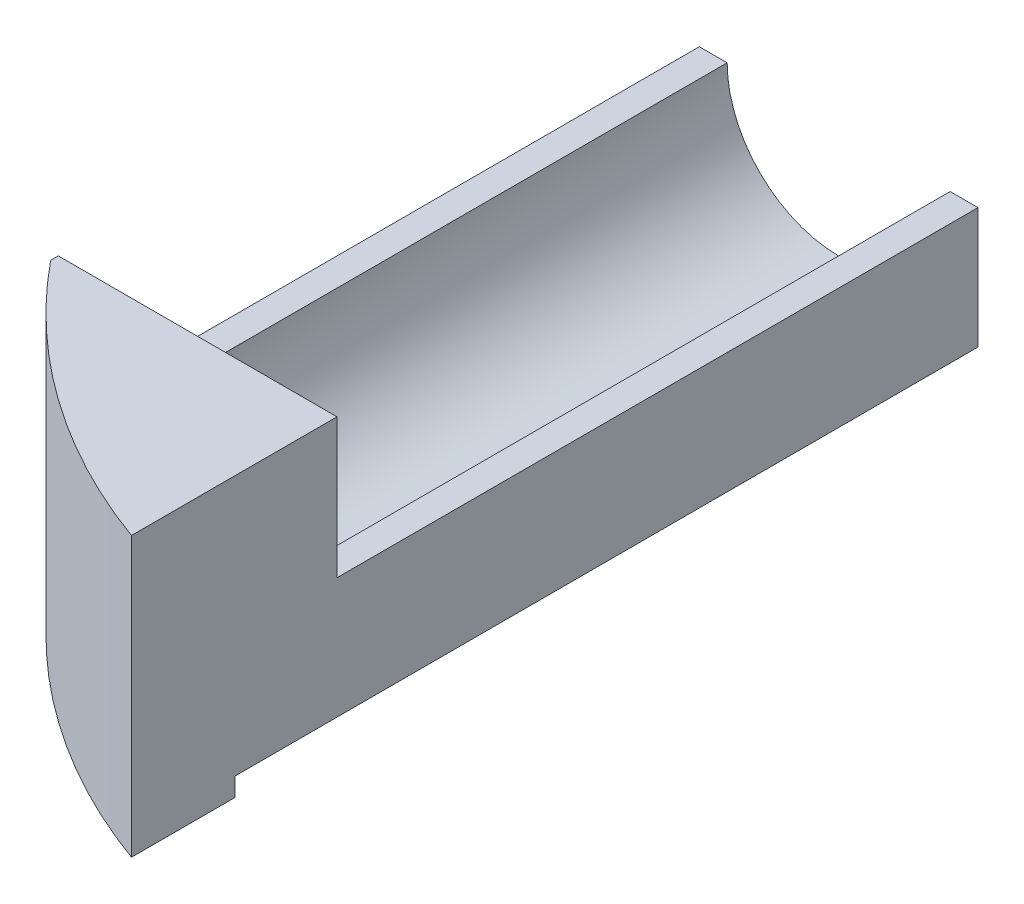
ISO-10303-21;
HEADER;
FILE_DESCRIPTION(('STEP AP214'),'2;1');
FILE_NAME('part.step','',(''),(''),'','','');
FILE_SCHEMA(('AUTOMOTIVE_DESIGN { 1 0 10303 214 1 1 1 1 }'));
ENDSEC;
DATA;
#1=APPLICATION_CONTEXT('core data for automotive mechanical design processes');
#2=APPLICATION_PROTOCOL_DEFINITION('international standard','automotive_design',2000,#1);
#3=PRODUCT_CONTEXT('',#1,'mechanical');
#4=PRODUCT('Part','Part','',(#3));
#5=PRODUCT_RELATED_PRODUCT_CATEGORY('part','',(#4));
#6=PRODUCT_DEFINITION_FORMATION('','',#4);
#7=PRODUCT_DEFINITION_CONTEXT('part definition',#1,'design');
#8=PRODUCT_DEFINITION('design','',#6,#7);
#9=PRODUCT_DEFINITION_SHAPE('','',#8);
#10=(LENGTH_UNIT() NAMED_UNIT(*) SI_UNIT(.MILLI.,.METRE.));
#11=(NAMED_UNIT(*) PLANE_ANGLE_UNIT() SI_UNIT($,.RADIAN.));
#12=(NAMED_UNIT(*) SI_UNIT($,.STERADIAN.) SOLID_ANGLE_UNIT());
#13=UNCERTAINTY_MEASURE_WITH_UNIT(LENGTH_MEASURE(1.E-05),#10,'distance_accuracy_value','');
#14=(GEOMETRIC_REPRESENTATION_CONTEXT(3) GLOBAL_UNCERTAINTY_ASSIGNED_CONTEXT((#13)) GLOBAL_UNIT_ASSIGNED_CONTEXT((#10,
#11,#12)) REPRESENTATION_CONTEXT('',''));
#15=CARTESIAN_POINT('',(0.,0.,0.));
#16=DIRECTION('',(0.,0.,1.));
#17=DIRECTION('',(1.,0.,0.));
#18=AXIS2_PLACEMENT_3D('',#15,#16,#17);
#19=CARTESIAN_POINT('',(-30.,30.,100.));
#20=DIRECTION('',(0.,-1.,0.));
#21=DIRECTION('',(0.,0.,-1.));
#22=AXIS2_PLACEMENT_3D('',#19,#20,#21);
#23=PLANE('',#22);
#24=DIRECTION('',(1.,0.,0.));
#25=VECTOR('',#24,1.);
#26=CARTESIAN_POINT('',(0.,30.,69.));
#27=LINE('',#26,#25);
#28=CARTESIAN_POINT('',(-30.,30.,69.));
#29=VERTEX_POINT('',#28);
#30=CARTESIAN_POINT('',(0.,30.,69.));
#31=VERTEX_POINT('',#30);
#32=EDGE_CURVE('E140',#29,#31,#27,.T.);
#33=ORIENTED_EDGE('',*,*,#32,.F.);
#34=DIRECTION('',(0.,0.,-1.));
#35=VECTOR('',#34,1.);
#36=CARTESIAN_POINT('',(-30.,30.,100.));
#37=LINE('',#36,#35);
#38=CARTESIAN_POINT('',(-30.,30.,69.8246485929605));
#39=VERTEX_POINT('',#38);
#40=EDGE_CURVE('E48',#39,#29,#37,.T.);
#41=ORIENTED_EDGE('',*,*,#40,.F.);
#42=CARTESIAN_POINT('',(23.5,30.,26.25));
#43=DIRECTION('',(0.,-1.,0.));
#44=DIRECTION('',(1.,0.,0.));
#45=AXIS2_PLACEMENT_3D('',#42,#43,#44);
#46=CIRCLE('',#45,69.);
#47=CARTESIAN_POINT('',(0.,30.,91.1248795759961));
#48=VERTEX_POINT('',#47);
#49=EDGE_CURVE('E162',#48,#39,#46,.T.);
#50=ORIENTED_EDGE('',*,*,#49,.F.);
#51=DIRECTION('',(0.,0.,-1.));
#52=VECTOR('',#51,1.);
#53=CARTESIAN_POINT('',(0.,30.,100.));
#54=LINE('',#53,#52);
#55=EDGE_CURVE('E12',#48,#31,#54,.T.);
#56=ORIENTED_EDGE('',*,*,#55,.T.);
#57=EDGE_LOOP('',(#33,#41,#50,#56));
#58=FACE_BOUND('',#57,.T.);
#59=ADVANCED_FACE('F40',(#58),#23,.F.);
#60=CARTESIAN_POINT('',(0.,30.,100.));
#61=DIRECTION('',(-1.,0.,0.));
#62=DIRECTION('',(0.,-1.,0.));
#63=AXIS2_PLACEMENT_3D('',#60,#61,#62);
#64=PLANE('',#63);
#65=DIRECTION('',(0.,-1.,0.));
#66=VECTOR('',#65,1.);
#67=CARTESIAN_POINT('',(0.,0.,80.));
#68=LINE('',#67,#66);
#69=CARTESIAN_POINT('',(0.,2.,80.));
#70=VERTEX_POINT('',#69);
#71=CARTESIAN_POINT('',(0.,0.,80.));
#72=VERTEX_POINT('',#71);
#73=EDGE_CURVE('E218',#70,#72,#68,.T.);
#74=ORIENTED_EDGE('',*,*,#73,.F.);
#75=DIRECTION('',(0.,0.,-1.));
#76=VECTOR('',#75,1.);
#77=CARTESIAN_POINT('',(0.,2.,80.));
#78=LINE('',#77,#76);
#79=CARTESIAN_POINT('',(0.,2.,0.));
#80=VERTEX_POINT('',#79);
#81=EDGE_CURVE('E153',#70,#80,#78,.T.);
#82=ORIENTED_EDGE('',*,*,#81,.T.);
#83=DIRECTION('',(0.,1.,0.));
#84=VECTOR('',#83,1.);
#85=CARTESIAN_POINT('',(0.,30.,0.));
#86=LINE('',#85,#84);
#87=CARTESIAN_POINT('',(0.,15.,0.));
#88=VERTEX_POINT('',#87);
#89=EDGE_CURVE('E170',#80,#88,#86,.T.);
#90=ORIENTED_EDGE('',*,*,#89,.T.);
#91=DIRECTION('',(0.,0.,-1.));
#92=VECTOR('',#91,1.);
#93=CARTESIAN_POINT('',(0.,15.,69.));
#94=LINE('',#93,#92);
#95=CARTESIAN_POINT('',(0.,15.,69.));
#96=VERTEX_POINT('',#95);
#97=EDGE_CURVE('E158',#96,#88,#94,.T.);
#98=ORIENTED_EDGE('',*,*,#97,.F.);
#99=DIRECTION('',(0.,-1.,0.));
#100=VECTOR('',#99,1.);
#101=CARTESIAN_POINT('',(0.,15.,69.));
#102=LINE('',#101,#100);
#103=EDGE_CURVE('E149',#31,#96,#102,.T.);
#104=ORIENTED_EDGE('',*,*,#103,.F.);
#105=ORIENTED_EDGE('',*,*,#55,.F.);
#106=DIRECTION('',(0.,-1.,0.));
#107=VECTOR('',#106,1.);
#108=CARTESIAN_POINT('',(0.,30.,91.1248795759961));
#109=LINE('',#108,#107);
#110=CARTESIAN_POINT('',(0.,0.,91.1248795759961));
#111=VERTEX_POINT('',#110);
#112=EDGE_CURVE('E168',#111,#48,#109,.F.);
#113=ORIENTED_EDGE('',*,*,#112,.F.);
#114=DIRECTION('',(0.,0.,-1.));
#115=VECTOR('',#114,1.);
#116=CARTESIAN_POINT('',(0.,0.,100.));
#117=LINE('',#116,#115);
#118=EDGE_CURVE('E177',#111,#72,#117,.T.);
#119=ORIENTED_EDGE('',*,*,#118,.T.);
#120=EDGE_LOOP('',(#74,#82,#90,#98,#104,#105,#113,#119));
#121=FACE_BOUND('',#120,.T.);
#122=ADVANCED_FACE('F42',(#121),#64,.F.);
#123=CARTESIAN_POINT('',(-30.,0.,100.));
#124=DIRECTION('',(1.,0.,0.));
#125=DIRECTION('',(0.,0.,-1.));
#126=AXIS2_PLACEMENT_3D('',#123,#124,#125);
#127=PLANE('',#126);
#128=DIRECTION('',(0.,1.,0.));
#129=VECTOR('',#128,1.);
#130=CARTESIAN_POINT('',(-30.,30.,69.));
#131=LINE('',#130,#129);
#132=CARTESIAN_POINT('',(-30.,15.,69.));
#133=VERTEX_POINT('',#132);
#134=EDGE_CURVE('E137',#133,#29,#131,.T.);
#135=ORIENTED_EDGE('',*,*,#134,.F.);
#136=DIRECTION('',(0.,0.,-1.));
#137=VECTOR('',#136,1.);
#138=CARTESIAN_POINT('',(-30.,15.,69.));
#139=LINE('',#138,#137);
#140=CARTESIAN_POINT('',(-30.,15.,0.));
#141=VERTEX_POINT('',#140);
#142=EDGE_CURVE('E133',#133,#141,#139,.T.);
#143=ORIENTED_EDGE('',*,*,#142,.T.);
#144=DIRECTION('',(0.,-1.,0.));
#145=VECTOR('',#144,1.);
#146=CARTESIAN_POINT('',(-30.,0.,0.));
#147=LINE('',#146,#145);
#148=CARTESIAN_POINT('',(-30.,0.,0.));
#149=VERTEX_POINT('',#148);
#150=EDGE_CURVE('E172',#141,#149,#147,.T.);
#151=ORIENTED_EDGE('',*,*,#150,.T.);
#152=DIRECTION('',(0.,0.,-1.));
#153=VECTOR('',#152,1.);
#154=CARTESIAN_POINT('',(-30.,0.,100.));
#155=LINE('',#154,#153);
#156=CARTESIAN_POINT('',(-30.,0.,69.8246485929605));
#157=VERTEX_POINT('',#156);
#158=EDGE_CURVE('E180',#157,#149,#155,.T.);
#159=ORIENTED_EDGE('',*,*,#158,.F.);
#160=DIRECTION('',(0.,-1.,0.));
#161=VECTOR('',#160,1.);
#162=CARTESIAN_POINT('',(-30.,30.,69.8246485929605));
#163=LINE('',#162,#161);
#164=EDGE_CURVE('E164',#39,#157,#163,.T.);
#165=ORIENTED_EDGE('',*,*,#164,.F.);
#166=ORIENTED_EDGE('',*,*,#40,.T.);
#167=EDGE_LOOP('',(#135,#143,#151,#159,#165,#166));
#168=FACE_BOUND('',#167,.T.);
#169=ADVANCED_FACE('F186',(#168),#127,.F.);
#170=CARTESIAN_POINT('',(0.,0.,100.));
#171=DIRECTION('',(0.,1.,0.));
#172=DIRECTION('',(-1.,0.,0.));
#173=AXIS2_PLACEMENT_3D('',#170,#171,#172);
#174=PLANE('',#173);
#175=DIRECTION('',(1.,0.,0.));
#176=VECTOR('',#175,1.);
#177=CARTESIAN_POINT('',(0.,0.,0.));
#178=LINE('',#177,#176);
#179=CARTESIAN_POINT('',(-2.,0.,0.));
#180=VERTEX_POINT('',#179);
#181=EDGE_CURVE('E174',#149,#180,#178,.T.);
#182=ORIENTED_EDGE('',*,*,#181,.T.);
#183=DIRECTION('',(0.,0.,-1.));
#184=VECTOR('',#183,1.);
#185=CARTESIAN_POINT('',(-2.,0.,80.));
#186=LINE('',#185,#184);
#187=CARTESIAN_POINT('',(-2.,0.,80.));
#188=VERTEX_POINT('',#187);
#189=EDGE_CURVE('E55',#188,#180,#186,.T.);
#190=ORIENTED_EDGE('',*,*,#189,.F.);
#191=DIRECTION('',(-1.,0.,0.));
#192=VECTOR('',#191,1.);
#193=CARTESIAN_POINT('',(-2.,0.,80.));
#194=LINE('',#193,#192);
#195=EDGE_CURVE('E210',#72,#188,#194,.T.);
#196=ORIENTED_EDGE('',*,*,#195,.F.);
#197=ORIENTED_EDGE('',*,*,#118,.F.);
#198=CARTESIAN_POINT('',(23.5,0.,26.25));
#199=DIRECTION('',(0.,-1.,0.));
#200=DIRECTION('',(1.,0.,0.));
#201=AXIS2_PLACEMENT_3D('',#198,#199,#200);
#202=CIRCLE('',#201,69.);
#203=EDGE_CURVE('E157',#111,#157,#202,.T.);
#204=ORIENTED_EDGE('',*,*,#203,.T.);
#205=ORIENTED_EDGE('',*,*,#158,.T.);
#206=EDGE_LOOP('',(#182,#190,#196,#197,#204,#205));
#207=FACE_BOUND('',#206,.T.);
#208=ADVANCED_FACE('F207',(#207),#174,.F.);
#209=CARTESIAN_POINT('',(0.,0.,0.));
#210=DIRECTION('',(0.,0.,-1.));
#211=DIRECTION('',(-1.,0.,0.));
#212=AXIS2_PLACEMENT_3D('',#209,#210,#211);
#213=PLANE('',#212);
#214=DIRECTION('',(0.707106781186547,0.707106781186548,0.));
#215=VECTOR('',#214,1.);
#216=CARTESIAN_POINT('',(0.,2.,0.));
#217=LINE('',#216,#215);
#218=EDGE_CURVE('E209',#180,#80,#217,.T.);
#219=ORIENTED_EDGE('',*,*,#218,.F.);
#220=ORIENTED_EDGE('',*,*,#181,.F.);
#221=ORIENTED_EDGE('',*,*,#150,.F.);
#222=DIRECTION('',(-1.,0.,0.));
#223=VECTOR('',#222,1.);
#224=CARTESIAN_POINT('',(-30.,15.,0.));
#225=LINE('',#224,#223);
#226=CARTESIAN_POINT('',(-27.,15.,0.));
#227=VERTEX_POINT('',#226);
#228=EDGE_CURVE('E143',#227,#141,#225,.T.);
#229=ORIENTED_EDGE('',*,*,#228,.F.);
#230=CARTESIAN_POINT('',(-15.,15.,0.));
#231=DIRECTION('',(0.,0.,-1.));
#232=DIRECTION('',(-1.,0.,0.));
#233=AXIS2_PLACEMENT_3D('',#230,#231,#232);
#234=CIRCLE('',#233,12.);
#235=CARTESIAN_POINT('',(-3.,15.,0.));
#236=VERTEX_POINT('',#235);
#237=EDGE_CURVE('E63',#236,#227,#234,.T.);
#238=ORIENTED_EDGE('',*,*,#237,.F.);
#239=DIRECTION('',(-1.,0.,0.));
#240=VECTOR('',#239,1.);
#241=CARTESIAN_POINT('',(-3.,15.,0.));
#242=LINE('',#241,#240);
#243=EDGE_CURVE('E138',#88,#236,#242,.T.);
#244=ORIENTED_EDGE('',*,*,#243,.F.);
#245=ORIENTED_EDGE('',*,*,#89,.F.);
#246=EDGE_LOOP('',(#219,#220,#221,#229,#238,#244,#245));
#247=FACE_BOUND('',#246,.T.);
#248=ADVANCED_FACE('F203',(#247),#213,.T.);
#249=CARTESIAN_POINT('',(23.5,30.,26.25));
#250=DIRECTION('',(0.,-1.,0.));
#251=DIRECTION('',(1.,0.,0.));
#252=AXIS2_PLACEMENT_3D('',#249,#250,#251);
#253=CYLINDRICAL_SURFACE('',#252,69.);
#254=ORIENTED_EDGE('',*,*,#112,.T.);
#255=ORIENTED_EDGE('',*,*,#49,.T.);
#256=ORIENTED_EDGE('',*,*,#164,.T.);
#257=ORIENTED_EDGE('',*,*,#203,.F.);
#258=EDGE_LOOP('',(#254,#255,#256,#257));
#259=FACE_BOUND('',#258,.T.);
#260=ADVANCED_FACE('F225',(#259),#253,.T.);
#261=CARTESIAN_POINT('',(-15.,15.,69.));
#262=DIRECTION('',(0.,0.,-1.));
#263=DIRECTION('',(-1.,0.,0.));
#264=AXIS2_PLACEMENT_3D('',#261,#262,#263);
#265=CYLINDRICAL_SURFACE('',#264,12.);
#266=ORIENTED_EDGE('',*,*,#237,.T.);
#267=DIRECTION('',(0.,0.,-1.));
#268=VECTOR('',#267,1.);
#269=CARTESIAN_POINT('',(-27.,15.,69.));
#270=LINE('',#269,#268);
#271=CARTESIAN_POINT('',(-27.,15.,69.));
#272=VERTEX_POINT('',#271);
#273=EDGE_CURVE('E128',#272,#227,#270,.T.);
#274=ORIENTED_EDGE('',*,*,#273,.F.);
#275=CARTESIAN_POINT('',(-15.,15.,69.));
#276=DIRECTION('',(0.,0.,-1.));
#277=DIRECTION('',(-1.,0.,0.));
#278=AXIS2_PLACEMENT_3D('',#275,#276,#277);
#279=CIRCLE('',#278,12.);
#280=CARTESIAN_POINT('',(-3.,15.,69.));
#281=VERTEX_POINT('',#280);
#282=EDGE_CURVE('E118',#272,#281,#279,.T.);
#283=ORIENTED_EDGE('',*,*,#282,.T.);
#284=DIRECTION('',(0.,0.,-1.));
#285=VECTOR('',#284,1.);
#286=CARTESIAN_POINT('',(-3.,15.,69.));
#287=LINE('',#286,#285);
#288=EDGE_CURVE('E155',#281,#236,#287,.T.);
#289=ORIENTED_EDGE('',*,*,#288,.T.);
#290=EDGE_LOOP('',(#266,#274,#283,#289));
#291=FACE_BOUND('',#290,.T.);
#292=CARTESIAN_POINT('',(-15.,15.,71.));
#293=DIRECTION('',(0.,0.,-1.));
#294=DIRECTION('',(-1.,0.,0.));
#295=AXIS2_PLACEMENT_3D('',#292,#293,#294);
#296=CIRCLE('',#295,12.);
#297=CARTESIAN_POINT('',(-27.,15.,71.));
#298=VERTEX_POINT('',#297);
#299=EDGE_CURVE('E126',#298,#298,#296,.T.);
#300=ORIENTED_EDGE('',*,*,#299,.F.);
#301=EDGE_LOOP('',(#300));
#302=FACE_BOUND('',#301,.T.);
#303=ADVANCED_FACE('F129',(#291,#302),#265,.F.);
#304=CARTESIAN_POINT('',(-3.,15.,69.));
#305=DIRECTION('',(0.,-1.,0.));
#306=DIRECTION('',(1.,0.,0.));
#307=AXIS2_PLACEMENT_3D('',#304,#305,#306);
#308=PLANE('',#307);
#309=ORIENTED_EDGE('',*,*,#243,.T.);
#310=ORIENTED_EDGE('',*,*,#288,.F.);
#311=DIRECTION('',(-1.,0.,0.));
#312=VECTOR('',#311,1.);
#313=CARTESIAN_POINT('',(-3.,15.,69.));
#314=LINE('',#313,#312);
#315=EDGE_CURVE('E124',#96,#281,#314,.T.);
#316=ORIENTED_EDGE('',*,*,#315,.F.);
#317=ORIENTED_EDGE('',*,*,#97,.T.);
#318=EDGE_LOOP('',(#309,#310,#316,#317));
#319=FACE_BOUND('',#318,.T.);
#320=ADVANCED_FACE('F201',(#319),#308,.F.);
#321=CARTESIAN_POINT('',(-30.,15.,69.));
#322=DIRECTION('',(0.,-1.,0.));
#323=DIRECTION('',(0.,0.,-1.));
#324=AXIS2_PLACEMENT_3D('',#321,#322,#323);
#325=PLANE('',#324);
#326=ORIENTED_EDGE('',*,*,#228,.T.);
#327=ORIENTED_EDGE('',*,*,#142,.F.);
#328=DIRECTION('',(-1.,0.,0.));
#329=VECTOR('',#328,1.);
#330=CARTESIAN_POINT('',(-30.,15.,69.));
#331=LINE('',#330,#329);
#332=EDGE_CURVE('E121',#272,#133,#331,.T.);
#333=ORIENTED_EDGE('',*,*,#332,.F.);
#334=ORIENTED_EDGE('',*,*,#273,.T.);
#335=EDGE_LOOP('',(#326,#327,#333,#334));
#336=FACE_BOUND('',#335,.T.);
#337=ADVANCED_FACE('F135',(#336),#325,.F.);
#338=CARTESIAN_POINT('',(-15.,15.,69.));
#339=DIRECTION('',(0.,0.,-1.));
#340=DIRECTION('',(-1.,0.,0.));
#341=AXIS2_PLACEMENT_3D('',#338,#339,#340);
#342=PLANE('',#341);
#343=ORIENTED_EDGE('',*,*,#282,.F.);
#344=ORIENTED_EDGE('',*,*,#332,.T.);
#345=ORIENTED_EDGE('',*,*,#134,.T.);
#346=ORIENTED_EDGE('',*,*,#32,.T.);
#347=ORIENTED_EDGE('',*,*,#103,.T.);
#348=ORIENTED_EDGE('',*,*,#315,.T.);
#349=EDGE_LOOP('',(#343,#344,#345,#346,#347,#348));
#350=FACE_BOUND('',#349,.T.);
#351=ADVANCED_FACE('F119',(#350),#342,.T.);
#352=CARTESIAN_POINT('',(0.,2.,80.));
#353=DIRECTION('',(-0.707106781186548,0.707106781186547,0.));
#354=DIRECTION('',(-0.707106781186547,-0.707106781186548,0.));
#355=AXIS2_PLACEMENT_3D('',#352,#353,#354);
#356=PLANE('',#355);
#357=ORIENTED_EDGE('',*,*,#218,.T.);
#358=ORIENTED_EDGE('',*,*,#81,.F.);
#359=DIRECTION('',(0.707106781186547,0.707106781186548,0.));
#360=VECTOR('',#359,1.);
#361=CARTESIAN_POINT('',(0.,2.,80.));
#362=LINE('',#361,#360);
#363=EDGE_CURVE('E213',#188,#70,#362,.T.);
#364=ORIENTED_EDGE('',*,*,#363,.F.);
#365=ORIENTED_EDGE('',*,*,#189,.T.);
#366=EDGE_LOOP('',(#357,#358,#364,#365));
#367=FACE_BOUND('',#366,.T.);
#368=ADVANCED_FACE('F255',(#367),#356,.F.);
#369=CARTESIAN_POINT('',(0.,0.,80.));
#370=DIRECTION('',(0.,0.,1.));
#371=DIRECTION('',(1.,0.,0.));
#372=AXIS2_PLACEMENT_3D('',#369,#370,#371);
#373=PLANE('',#372);
#374=ORIENTED_EDGE('',*,*,#195,.T.);
#375=ORIENTED_EDGE('',*,*,#363,.T.);
#376=ORIENTED_EDGE('',*,*,#73,.T.);
#377=EDGE_LOOP('',(#374,#375,#376));
#378=FACE_BOUND('',#377,.T.);
#379=ADVANCED_FACE('F223',(#378),#373,.F.);
#380=CARTESIAN_POINT('',(-15.,15.,71.));
#381=DIRECTION('',(0.,0.,-1.));
#382=DIRECTION('',(-1.,0.,0.));
#383=AXIS2_PLACEMENT_3D('',#380,#381,#382);
#384=PLANE('',#383);
#385=ORIENTED_EDGE('',*,*,#299,.T.);
#386=EDGE_LOOP('',(#385));
#387=FACE_BOUND('',#386,.T.);
#388=ADVANCED_FACE('F266',(#387),#384,.T.);
#389=CLOSED_SHELL('',(#59,#122,#169,#208,#248,#260,#303,#320,#337,#351,#368,#379,#388));
#390=MANIFOLD_SOLID_BREP('B2',#389);
#391=ADVANCED_BREP_SHAPE_REPRESENTATION('',(#18,#390),#14);
#392=SHAPE_DEFINITION_REPRESENTATION(#9,#391);
ENDSEC;
END-ISO-10303-21;
